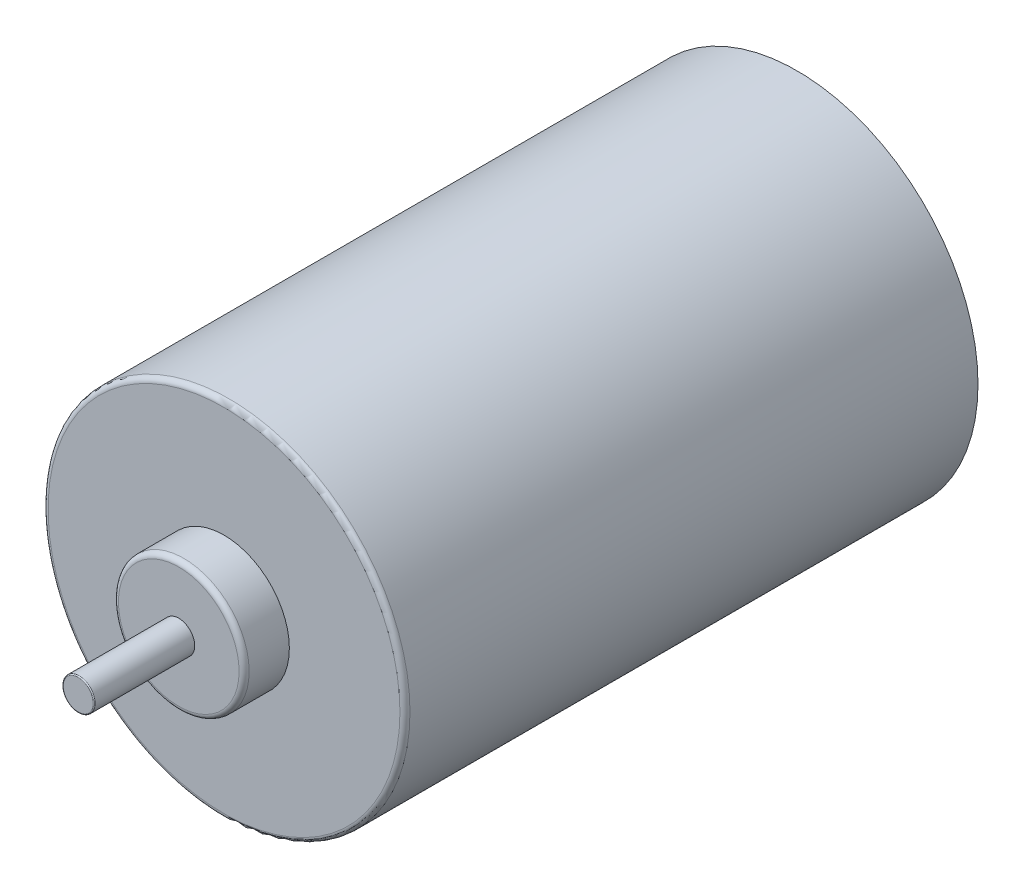
ISO-10303-21;
HEADER;
FILE_DESCRIPTION(('STEP AP214'),'2;1');
FILE_NAME('part.step','',(''),(''),'','','');
FILE_SCHEMA(('AUTOMOTIVE_DESIGN { 1 0 10303 214 1 1 1 1 }'));
ENDSEC;
DATA;
#1=APPLICATION_CONTEXT('core data for automotive mechanical design processes');
#2=APPLICATION_PROTOCOL_DEFINITION('international standard','automotive_design',2000,#1);
#3=PRODUCT_CONTEXT('',#1,'mechanical');
#4=PRODUCT('Part','Part','',(#3));
#5=PRODUCT_RELATED_PRODUCT_CATEGORY('part','',(#4));
#6=PRODUCT_DEFINITION_FORMATION('','',#4);
#7=PRODUCT_DEFINITION_CONTEXT('part definition',#1,'design');
#8=PRODUCT_DEFINITION('design','',#6,#7);
#9=PRODUCT_DEFINITION_SHAPE('','',#8);
#10=(LENGTH_UNIT() NAMED_UNIT(*) SI_UNIT(.MILLI.,.METRE.));
#11=(NAMED_UNIT(*) PLANE_ANGLE_UNIT() SI_UNIT($,.RADIAN.));
#12=(NAMED_UNIT(*) SI_UNIT($,.STERADIAN.) SOLID_ANGLE_UNIT());
#13=UNCERTAINTY_MEASURE_WITH_UNIT(LENGTH_MEASURE(1.E-05),#10,'distance_accuracy_value','');
#14=(GEOMETRIC_REPRESENTATION_CONTEXT(3) GLOBAL_UNCERTAINTY_ASSIGNED_CONTEXT((#13)) GLOBAL_UNIT_ASSIGNED_CONTEXT((#10,
#11,#12)) REPRESENTATION_CONTEXT('',''));
#15=CARTESIAN_POINT('',(0.,0.,0.));
#16=DIRECTION('',(0.,0.,1.));
#17=DIRECTION('',(1.,0.,0.));
#18=AXIS2_PLACEMENT_3D('',#15,#16,#17);
#19=CARTESIAN_POINT('',(0.,0.,-3.5));
#20=DIRECTION('',(0.,0.,1.));
#21=DIRECTION('',(1.,0.,0.));
#22=AXIS2_PLACEMENT_3D('',#19,#20,#21);
#23=CYLINDRICAL_SURFACE('',#22,1.5875);
#24=CARTESIAN_POINT('',(0.,0.,-3.4));
#25=DIRECTION('',(0.,0.,1.));
#26=DIRECTION('',(1.,0.,0.));
#27=AXIS2_PLACEMENT_3D('',#24,#25,#26);
#28=CIRCLE('',#27,1.5875);
#29=CARTESIAN_POINT('',(1.5875,0.,-3.4));
#30=VERTEX_POINT('',#29);
#31=EDGE_CURVE('E60',#30,#30,#28,.T.);
#32=ORIENTED_EDGE('',*,*,#31,.T.);
#33=EDGE_LOOP('',(#32));
#34=FACE_BOUND('',#33,.T.);
#35=CARTESIAN_POINT('',(0.,0.,71.4));
#36=DIRECTION('',(0.,0.,1.));
#37=DIRECTION('',(1.,0.,0.));
#38=AXIS2_PLACEMENT_3D('',#35,#36,#37);
#39=CIRCLE('',#38,1.5875);
#40=CARTESIAN_POINT('',(1.5875,0.,71.4));
#41=VERTEX_POINT('',#40);
#42=EDGE_CURVE('E64',#41,#41,#39,.F.);
#43=ORIENTED_EDGE('',*,*,#42,.T.);
#44=EDGE_LOOP('',(#43));
#45=FACE_BOUND('',#44,.T.);
#46=ADVANCED_FACE('F53',(#34,#45),#23,.T.);
#47=CARTESIAN_POINT('',(0.,0.,-3.5));
#48=DIRECTION('',(0.,0.,1.));
#49=DIRECTION('',(1.,0.,0.));
#50=AXIS2_PLACEMENT_3D('',#47,#48,#49);
#51=PLANE('',#50);
#52=CARTESIAN_POINT('',(0.,0.,-3.5));
#53=DIRECTION('',(0.,0.,1.));
#54=DIRECTION('',(1.,0.,0.));
#55=AXIS2_PLACEMENT_3D('',#52,#53,#54);
#56=CIRCLE('',#55,1.4875);
#57=CARTESIAN_POINT('',(1.4875,0.,-3.5));
#58=VERTEX_POINT('',#57);
#59=EDGE_CURVE('E11',#58,#58,#56,.F.);
#60=ORIENTED_EDGE('',*,*,#59,.T.);
#61=EDGE_LOOP('',(#60));
#62=FACE_BOUND('',#61,.T.);
#63=ADVANCED_FACE('F85',(#62),#51,.F.);
#64=CARTESIAN_POINT('',(0.,0.,71.5));
#65=DIRECTION('',(0.,0.,1.));
#66=DIRECTION('',(1.,0.,0.));
#67=AXIS2_PLACEMENT_3D('',#64,#65,#66);
#68=PLANE('',#67);
#69=CARTESIAN_POINT('',(0.,0.,71.5));
#70=DIRECTION('',(0.,0.,1.));
#71=DIRECTION('',(1.,0.,0.));
#72=AXIS2_PLACEMENT_3D('',#69,#70,#71);
#73=CIRCLE('',#72,1.4875);
#74=CARTESIAN_POINT('',(1.4875,0.,71.5));
#75=VERTEX_POINT('',#74);
#76=EDGE_CURVE('E68',#75,#75,#73,.T.);
#77=ORIENTED_EDGE('',*,*,#76,.T.);
#78=EDGE_LOOP('',(#77));
#79=FACE_BOUND('',#78,.T.);
#80=ADVANCED_FACE('F74',(#79),#68,.T.);
#81=CARTESIAN_POINT('',(0.,0.,71.4));
#82=DIRECTION('',(0.,0.,1.));
#83=DIRECTION('',(1.,0.,0.));
#84=AXIS2_PLACEMENT_3D('',#81,#82,#83);
#85=TOROIDAL_SURFACE('',#84,1.4875,0.1);
#86=ORIENTED_EDGE('',*,*,#42,.F.);
#87=EDGE_LOOP('',(#86));
#88=FACE_BOUND('',#87,.T.);
#89=ORIENTED_EDGE('',*,*,#76,.F.);
#90=EDGE_LOOP('',(#89));
#91=FACE_BOUND('',#90,.T.);
#92=ADVANCED_FACE('F76',(#88,#91),#85,.T.);
#93=CARTESIAN_POINT('',(0.,0.,-3.4));
#94=DIRECTION('',(0.,0.,1.));
#95=DIRECTION('',(1.,0.,0.));
#96=AXIS2_PLACEMENT_3D('',#93,#94,#95);
#97=TOROIDAL_SURFACE('',#96,1.4875,0.1);
#98=ORIENTED_EDGE('',*,*,#59,.F.);
#99=EDGE_LOOP('',(#98));
#100=FACE_BOUND('',#99,.T.);
#101=ORIENTED_EDGE('',*,*,#31,.F.);
#102=EDGE_LOOP('',(#101));
#103=FACE_BOUND('',#102,.T.);
#104=ADVANCED_FACE('F55',(#100,#103),#97,.T.);
#105=CLOSED_SHELL('',(#46,#63,#80,#92,#104));
#106=MANIFOLD_SOLID_BREP('B2',#105);
#107=CARTESIAN_POINT('',(0.,0.,57.));
#108=DIRECTION('',(0.,0.,-1.));
#109=DIRECTION('',(-1.,0.,0.));
#110=AXIS2_PLACEMENT_3D('',#107,#108,#109);
#111=CYLINDRICAL_SURFACE('',#110,17.);
#112=CARTESIAN_POINT('',(0.,0.,2.));
#113=DIRECTION('',(0.,0.,-1.));
#114=DIRECTION('',(-1.,0.,0.));
#115=AXIS2_PLACEMENT_3D('',#112,#113,#114);
#116=CIRCLE('',#115,17.);
#117=CARTESIAN_POINT('',(-17.,0.,2.));
#118=VERTEX_POINT('',#117);
#119=EDGE_CURVE('E158',#118,#118,#116,.T.);
#120=ORIENTED_EDGE('',*,*,#119,.T.);
#121=EDGE_LOOP('',(#120));
#122=FACE_BOUND('',#121,.T.);
#123=CARTESIAN_POINT('',(0.,0.,56.));
#124=DIRECTION('',(0.,0.,1.));
#125=DIRECTION('',(1.,0.,0.));
#126=AXIS2_PLACEMENT_3D('',#123,#124,#125);
#127=CIRCLE('',#126,17.);
#128=CARTESIAN_POINT('',(17.,0.,56.));
#129=VERTEX_POINT('',#128);
#130=EDGE_CURVE('E178',#129,#129,#127,.T.);
#131=ORIENTED_EDGE('',*,*,#130,.T.);
#132=EDGE_LOOP('',(#131));
#133=FACE_BOUND('',#132,.T.);
#134=ADVANCED_FACE('F124',(#122,#133),#111,.F.);
#135=CARTESIAN_POINT('',(0.,0.,57.));
#136=DIRECTION('',(0.,0.,1.));
#137=DIRECTION('',(1.,0.,0.));
#138=AXIS2_PLACEMENT_3D('',#135,#136,#137);
#139=PLANE('',#138);
#140=CARTESIAN_POINT('',(0.,0.,57.));
#141=DIRECTION('',(0.,0.,1.));
#142=DIRECTION('',(1.,0.,0.));
#143=AXIS2_PLACEMENT_3D('',#140,#141,#142);
#144=CIRCLE('',#143,17.5);
#145=CARTESIAN_POINT('',(17.5,0.,57.));
#146=VERTEX_POINT('',#145);
#147=EDGE_CURVE('E143',#146,#146,#144,.T.);
#148=ORIENTED_EDGE('',*,*,#147,.T.);
#149=EDGE_LOOP('',(#148));
#150=FACE_BOUND('',#149,.T.);
#151=CARTESIAN_POINT('',(0.,0.,57.));
#152=DIRECTION('',(0.,0.,1.));
#153=DIRECTION('',(1.,0.,0.));
#154=AXIS2_PLACEMENT_3D('',#151,#152,#153);
#155=CIRCLE('',#154,6.5);
#156=CARTESIAN_POINT('',(6.5,0.,57.));
#157=VERTEX_POINT('',#156);
#158=EDGE_CURVE('E157',#157,#157,#155,.T.);
#159=ORIENTED_EDGE('',*,*,#158,.F.);
#160=EDGE_LOOP('',(#159));
#161=FACE_BOUND('',#160,.T.);
#162=ADVANCED_FACE('F213',(#150,#161),#139,.T.);
#163=CARTESIAN_POINT('',(0.,0.,0.));
#164=DIRECTION('',(0.,0.,1.));
#165=DIRECTION('',(1.,0.,0.));
#166=AXIS2_PLACEMENT_3D('',#163,#164,#165);
#167=PLANE('',#166);
#168=CARTESIAN_POINT('',(0.,0.,0.));
#169=DIRECTION('',(0.,0.,-1.));
#170=DIRECTION('',(-1.,0.,0.));
#171=AXIS2_PLACEMENT_3D('',#168,#169,#170);
#172=CIRCLE('',#171,13.);
#173=CARTESIAN_POINT('',(-13.,0.,0.));
#174=VERTEX_POINT('',#173);
#175=EDGE_CURVE('E167',#174,#174,#172,.T.);
#176=ORIENTED_EDGE('',*,*,#175,.F.);
#177=EDGE_LOOP('',(#176));
#178=FACE_BOUND('',#177,.T.);
#179=CARTESIAN_POINT('',(0.,0.,0.));
#180=DIRECTION('',(0.,0.,1.));
#181=DIRECTION('',(1.,0.,0.));
#182=AXIS2_PLACEMENT_3D('',#179,#180,#181);
#183=CIRCLE('',#182,18.);
#184=CARTESIAN_POINT('',(18.,0.,0.));
#185=VERTEX_POINT('',#184);
#186=EDGE_CURVE('E162',#185,#185,#183,.T.);
#187=ORIENTED_EDGE('',*,*,#186,.F.);
#188=EDGE_LOOP('',(#187));
#189=FACE_BOUND('',#188,.T.);
#190=ADVANCED_FACE('F221',(#178,#189),#167,.F.);
#191=CARTESIAN_POINT('',(0.,0.,57.));
#192=DIRECTION('',(0.,0.,-1.));
#193=DIRECTION('',(-1.,0.,0.));
#194=AXIS2_PLACEMENT_3D('',#191,#192,#193);
#195=CYLINDRICAL_SURFACE('',#194,18.);
#196=CARTESIAN_POINT('',(0.,0.,56.5));
#197=DIRECTION('',(0.,0.,1.));
#198=DIRECTION('',(1.,0.,0.));
#199=AXIS2_PLACEMENT_3D('',#196,#197,#198);
#200=CIRCLE('',#199,18.);
#201=CARTESIAN_POINT('',(18.,0.,56.5));
#202=VERTEX_POINT('',#201);
#203=EDGE_CURVE('E138',#202,#202,#200,.F.);
#204=ORIENTED_EDGE('',*,*,#203,.T.);
#205=EDGE_LOOP('',(#204));
#206=FACE_BOUND('',#205,.T.);
#207=ORIENTED_EDGE('',*,*,#186,.T.);
#208=EDGE_LOOP('',(#207));
#209=FACE_BOUND('',#208,.T.);
#210=ADVANCED_FACE('F231',(#206,#209),#195,.T.);
#211=CARTESIAN_POINT('',(0.,0.,2.));
#212=DIRECTION('',(0.,0.,-1.));
#213=DIRECTION('',(-1.,0.,0.));
#214=AXIS2_PLACEMENT_3D('',#211,#212,#213);
#215=PLANE('',#214);
#216=CARTESIAN_POINT('',(0.,0.,2.));
#217=DIRECTION('',(0.,0.,-1.));
#218=DIRECTION('',(-1.,0.,0.));
#219=AXIS2_PLACEMENT_3D('',#216,#217,#218);
#220=CIRCLE('',#219,1.5875);
#221=CARTESIAN_POINT('',(-1.5875,0.,2.));
#222=VERTEX_POINT('',#221);
#223=EDGE_CURVE('E163',#222,#222,#220,.F.);
#224=ORIENTED_EDGE('',*,*,#223,.F.);
#225=EDGE_LOOP('',(#224));
#226=FACE_BOUND('',#225,.T.);
#227=ORIENTED_EDGE('',*,*,#119,.F.);
#228=EDGE_LOOP('',(#227));
#229=FACE_BOUND('',#228,.T.);
#230=ADVANCED_FACE('F226',(#226,#229),#215,.F.);
#231=CARTESIAN_POINT('',(0.,0.,-2.));
#232=DIRECTION('',(0.,0.,1.));
#233=DIRECTION('',(1.,0.,0.));
#234=AXIS2_PLACEMENT_3D('',#231,#232,#233);
#235=CYLINDRICAL_SURFACE('',#234,13.);
#236=CARTESIAN_POINT('',(0.,0.,-1.00000000000001));
#237=DIRECTION('',(0.,0.,-1.));
#238=DIRECTION('',(-1.,0.,0.));
#239=AXIS2_PLACEMENT_3D('',#236,#237,#238);
#240=CIRCLE('',#239,13.);
#241=CARTESIAN_POINT('',(-13.,0.,-1.00000000000001));
#242=VERTEX_POINT('',#241);
#243=EDGE_CURVE('E52',#242,#242,#240,.F.);
#244=ORIENTED_EDGE('',*,*,#243,.T.);
#245=EDGE_LOOP('',(#244));
#246=FACE_BOUND('',#245,.T.);
#247=ORIENTED_EDGE('',*,*,#175,.T.);
#248=EDGE_LOOP('',(#247));
#249=FACE_BOUND('',#248,.T.);
#250=ADVANCED_FACE('F265',(#246,#249),#235,.T.);
#251=CARTESIAN_POINT('',(0.,0.,-2.));
#252=DIRECTION('',(0.,0.,-1.));
#253=DIRECTION('',(-1.,0.,0.));
#254=AXIS2_PLACEMENT_3D('',#251,#252,#253);
#255=PLANE('',#254);
#256=CARTESIAN_POINT('',(0.,0.,-2.));
#257=DIRECTION('',(0.,0.,-1.));
#258=DIRECTION('',(-1.,0.,0.));
#259=AXIS2_PLACEMENT_3D('',#256,#257,#258);
#260=CIRCLE('',#259,12.);
#261=CARTESIAN_POINT('',(-12.,0.,-2.));
#262=VERTEX_POINT('',#261);
#263=EDGE_CURVE('E133',#262,#262,#260,.T.);
#264=ORIENTED_EDGE('',*,*,#263,.T.);
#265=EDGE_LOOP('',(#264));
#266=FACE_BOUND('',#265,.T.);
#267=CARTESIAN_POINT('',(0.,0.,-2.));
#268=DIRECTION('',(0.,0.,-1.));
#269=DIRECTION('',(-1.,0.,0.));
#270=AXIS2_PLACEMENT_3D('',#267,#268,#269);
#271=CIRCLE('',#270,1.5875);
#272=CARTESIAN_POINT('',(-1.5875,0.,-2.));
#273=VERTEX_POINT('',#272);
#274=EDGE_CURVE('E174',#273,#273,#271,.T.);
#275=ORIENTED_EDGE('',*,*,#274,.F.);
#276=EDGE_LOOP('',(#275));
#277=FACE_BOUND('',#276,.T.);
#278=ADVANCED_FACE('F261',(#266,#277),#255,.T.);
#279=CARTESIAN_POINT('',(0.,0.,6.49012806053458));
#280=DIRECTION('',(0.,0.,-1.));
#281=DIRECTION('',(-1.,0.,0.));
#282=AXIS2_PLACEMENT_3D('',#279,#280,#281);
#283=CYLINDRICAL_SURFACE('',#282,1.5875);
#284=ORIENTED_EDGE('',*,*,#223,.T.);
#285=EDGE_LOOP('',(#284));
#286=FACE_BOUND('',#285,.T.);
#287=ORIENTED_EDGE('',*,*,#274,.T.);
#288=EDGE_LOOP('',(#287));
#289=FACE_BOUND('',#288,.T.);
#290=ADVANCED_FACE('F264',(#286,#289),#283,.F.);
#291=CARTESIAN_POINT('',(0.,0.,56.));
#292=DIRECTION('',(0.,0.,1.));
#293=DIRECTION('',(1.,0.,0.));
#294=AXIS2_PLACEMENT_3D('',#291,#292,#293);
#295=PLANE('',#294);
#296=CARTESIAN_POINT('',(0.,0.,56.));
#297=DIRECTION('',(0.,0.,1.));
#298=DIRECTION('',(1.,0.,0.));
#299=AXIS2_PLACEMENT_3D('',#296,#297,#298);
#300=CIRCLE('',#299,1.5875);
#301=CARTESIAN_POINT('',(1.5875,0.,56.));
#302=VERTEX_POINT('',#301);
#303=EDGE_CURVE('E182',#302,#302,#300,.T.);
#304=ORIENTED_EDGE('',*,*,#303,.T.);
#305=EDGE_LOOP('',(#304));
#306=FACE_BOUND('',#305,.T.);
#307=ORIENTED_EDGE('',*,*,#130,.F.);
#308=EDGE_LOOP('',(#307));
#309=FACE_BOUND('',#308,.T.);
#310=ADVANCED_FACE('F209',(#306,#309),#295,.F.);
#311=CARTESIAN_POINT('',(0.,0.,61.5));
#312=DIRECTION('',(0.,0.,-1.));
#313=DIRECTION('',(-1.,0.,0.));
#314=AXIS2_PLACEMENT_3D('',#311,#312,#313);
#315=CYLINDRICAL_SURFACE('',#314,6.5);
#316=CARTESIAN_POINT('',(0.,0.,61.));
#317=DIRECTION('',(0.,0.,1.));
#318=DIRECTION('',(1.,0.,0.));
#319=AXIS2_PLACEMENT_3D('',#316,#317,#318);
#320=CIRCLE('',#319,6.5);
#321=CARTESIAN_POINT('',(6.5,0.,61.));
#322=VERTEX_POINT('',#321);
#323=EDGE_CURVE('E149',#322,#322,#320,.F.);
#324=ORIENTED_EDGE('',*,*,#323,.T.);
#325=EDGE_LOOP('',(#324));
#326=FACE_BOUND('',#325,.T.);
#327=ORIENTED_EDGE('',*,*,#158,.T.);
#328=EDGE_LOOP('',(#327));
#329=FACE_BOUND('',#328,.T.);
#330=ADVANCED_FACE('F199',(#326,#329),#315,.T.);
#331=CARTESIAN_POINT('',(0.,0.,61.5));
#332=DIRECTION('',(0.,0.,1.));
#333=DIRECTION('',(1.,0.,0.));
#334=AXIS2_PLACEMENT_3D('',#331,#332,#333);
#335=PLANE('',#334);
#336=CARTESIAN_POINT('',(0.,0.,61.5));
#337=DIRECTION('',(0.,0.,1.));
#338=DIRECTION('',(1.,0.,0.));
#339=AXIS2_PLACEMENT_3D('',#336,#337,#338);
#340=CIRCLE('',#339,6.);
#341=CARTESIAN_POINT('',(6.,0.,61.5));
#342=VERTEX_POINT('',#341);
#343=EDGE_CURVE('E153',#342,#342,#340,.T.);
#344=ORIENTED_EDGE('',*,*,#343,.T.);
#345=EDGE_LOOP('',(#344));
#346=FACE_BOUND('',#345,.T.);
#347=CARTESIAN_POINT('',(0.,0.,61.5));
#348=DIRECTION('',(0.,0.,1.));
#349=DIRECTION('',(1.,0.,0.));
#350=AXIS2_PLACEMENT_3D('',#347,#348,#349);
#351=CIRCLE('',#350,1.5875);
#352=CARTESIAN_POINT('',(1.5875,0.,61.5));
#353=VERTEX_POINT('',#352);
#354=EDGE_CURVE('E189',#353,#353,#351,.T.);
#355=ORIENTED_EDGE('',*,*,#354,.F.);
#356=EDGE_LOOP('',(#355));
#357=FACE_BOUND('',#356,.T.);
#358=ADVANCED_FACE('F197',(#346,#357),#335,.T.);
#359=CARTESIAN_POINT('',(0.,0.,-2.));
#360=DIRECTION('',(0.,0.,1.));
#361=DIRECTION('',(1.,0.,0.));
#362=AXIS2_PLACEMENT_3D('',#359,#360,#361);
#363=CYLINDRICAL_SURFACE('',#362,1.5875);
#364=ORIENTED_EDGE('',*,*,#354,.T.);
#365=EDGE_LOOP('',(#364));
#366=FACE_BOUND('',#365,.T.);
#367=ORIENTED_EDGE('',*,*,#303,.F.);
#368=EDGE_LOOP('',(#367));
#369=FACE_BOUND('',#368,.T.);
#370=ADVANCED_FACE('F194',(#366,#369),#363,.F.);
#371=CARTESIAN_POINT('',(0.,0.,61.));
#372=DIRECTION('',(0.,0.,1.));
#373=DIRECTION('',(1.,0.,0.));
#374=AXIS2_PLACEMENT_3D('',#371,#372,#373);
#375=TOROIDAL_SURFACE('',#374,6.,0.5);
#376=ORIENTED_EDGE('',*,*,#323,.F.);
#377=EDGE_LOOP('',(#376));
#378=FACE_BOUND('',#377,.T.);
#379=ORIENTED_EDGE('',*,*,#343,.F.);
#380=EDGE_LOOP('',(#379));
#381=FACE_BOUND('',#380,.T.);
#382=ADVANCED_FACE('F207',(#378,#381),#375,.T.);
#383=CARTESIAN_POINT('',(0.,0.,56.5));
#384=DIRECTION('',(0.,0.,1.));
#385=DIRECTION('',(1.,0.,0.));
#386=AXIS2_PLACEMENT_3D('',#383,#384,#385);
#387=TOROIDAL_SURFACE('',#386,17.5,0.5);
#388=ORIENTED_EDGE('',*,*,#203,.F.);
#389=EDGE_LOOP('',(#388));
#390=FACE_BOUND('',#389,.T.);
#391=ORIENTED_EDGE('',*,*,#147,.F.);
#392=EDGE_LOOP('',(#391));
#393=FACE_BOUND('',#392,.T.);
#394=ADVANCED_FACE('F236',(#390,#393),#387,.T.);
#395=CARTESIAN_POINT('',(0.,0.,-2.));
#396=DIRECTION('',(0.,0.,1.));
#397=DIRECTION('',(1.,0.,0.));
#398=AXIS2_PLACEMENT_3D('',#395,#396,#397);
#399=CONICAL_SURFACE('',#398,12.,0.785398163397443);
#400=ORIENTED_EDGE('',*,*,#243,.F.);
#401=EDGE_LOOP('',(#400));
#402=FACE_BOUND('',#401,.T.);
#403=ORIENTED_EDGE('',*,*,#263,.F.);
#404=EDGE_LOOP('',(#403));
#405=FACE_BOUND('',#404,.T.);
#406=ADVANCED_FACE('F127',(#402,#405),#399,.T.);
#407=CLOSED_SHELL('',(#134,#162,#190,#210,#230,#250,#278,#290,#310,#330,#358,#370,#382,#394,#406));
#408=MANIFOLD_SOLID_BREP('B6',#407);
#409=ADVANCED_BREP_SHAPE_REPRESENTATION('',(#18,#106,#408),#14);
#410=SHAPE_DEFINITION_REPRESENTATION(#9,#409);
ENDSEC;
END-ISO-10303-21;
